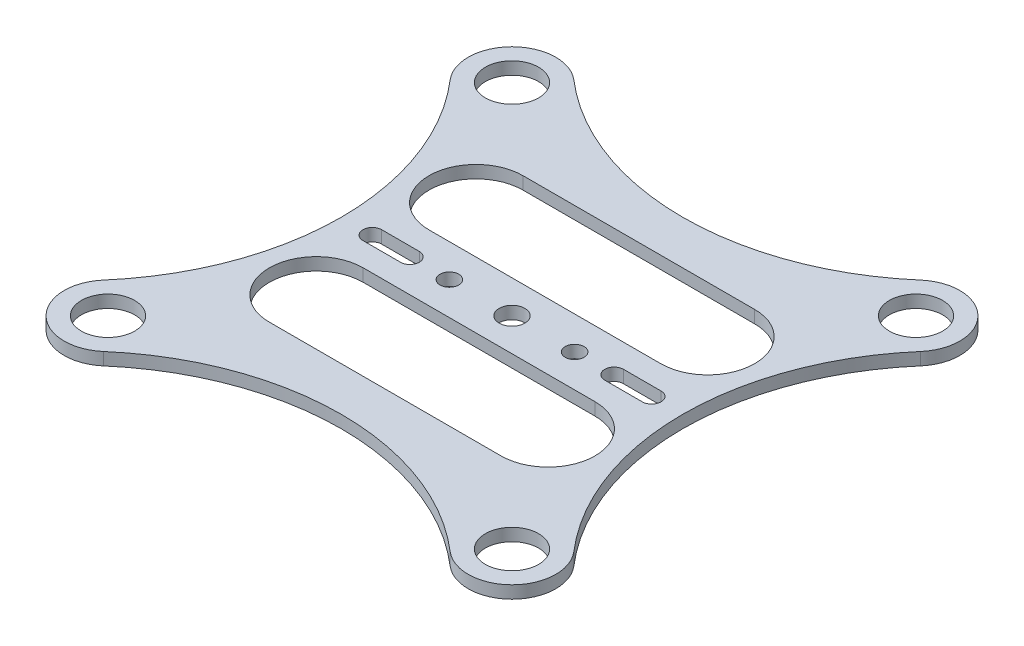
ISO-10303-21;
HEADER;
FILE_DESCRIPTION(('STEP AP214'),'2;1');
FILE_NAME('part.step','',(''),(''),'','','');
FILE_SCHEMA(('AUTOMOTIVE_DESIGN { 1 0 10303 214 1 1 1 1 }'));
ENDSEC;
DATA;
#1=APPLICATION_CONTEXT('core data for automotive mechanical design processes');
#2=APPLICATION_PROTOCOL_DEFINITION('international standard','automotive_design',2000,#1);
#3=PRODUCT_CONTEXT('',#1,'mechanical');
#4=PRODUCT('Part','Part','',(#3));
#5=PRODUCT_RELATED_PRODUCT_CATEGORY('part','',(#4));
#6=PRODUCT_DEFINITION_FORMATION('','',#4);
#7=PRODUCT_DEFINITION_CONTEXT('part definition',#1,'design');
#8=PRODUCT_DEFINITION('design','',#6,#7);
#9=PRODUCT_DEFINITION_SHAPE('','',#8);
#10=(LENGTH_UNIT() NAMED_UNIT(*) SI_UNIT(.MILLI.,.METRE.));
#11=(NAMED_UNIT(*) PLANE_ANGLE_UNIT() SI_UNIT($,.RADIAN.));
#12=(NAMED_UNIT(*) SI_UNIT($,.STERADIAN.) SOLID_ANGLE_UNIT());
#13=UNCERTAINTY_MEASURE_WITH_UNIT(LENGTH_MEASURE(1.E-05),#10,'distance_accuracy_value','');
#14=(GEOMETRIC_REPRESENTATION_CONTEXT(3) GLOBAL_UNCERTAINTY_ASSIGNED_CONTEXT((#13)) GLOBAL_UNIT_ASSIGNED_CONTEXT((#10,
#11,#12)) REPRESENTATION_CONTEXT('',''));
#15=CARTESIAN_POINT('',(0.,0.,0.));
#16=DIRECTION('',(0.,0.,1.));
#17=DIRECTION('',(1.,0.,0.));
#18=AXIS2_PLACEMENT_3D('',#15,#16,#17);
#19=CARTESIAN_POINT('',(0.,2.,0.));
#20=DIRECTION('',(0.,1.,0.));
#21=DIRECTION('',(0.,0.,1.));
#22=AXIS2_PLACEMENT_3D('',#19,#20,#21);
#23=PLANE('',#22);
#24=CARTESIAN_POINT('',(-32.25,2.,32.25));
#25=DIRECTION('',(0.,1.,0.));
#26=DIRECTION('',(0.,0.,1.));
#27=AXIS2_PLACEMENT_3D('',#24,#25,#26);
#28=CIRCLE('',#27,4.25);
#29=CARTESIAN_POINT('',(-32.25,2.,36.5));
#30=VERTEX_POINT('',#29);
#31=EDGE_CURVE('E328',#30,#30,#28,.F.);
#32=ORIENTED_EDGE('',*,*,#31,.T.);
#33=EDGE_LOOP('',(#32));
#34=FACE_BOUND('',#33,.T.);
#35=CARTESIAN_POINT('',(-32.25,2.,-32.25));
#36=DIRECTION('',(0.,1.,0.));
#37=DIRECTION('',(0.,0.,1.));
#38=AXIS2_PLACEMENT_3D('',#35,#36,#37);
#39=CIRCLE('',#38,4.25);
#40=CARTESIAN_POINT('',(-32.25,2.,-28.));
#41=VERTEX_POINT('',#40);
#42=EDGE_CURVE('E331',#41,#41,#39,.F.);
#43=ORIENTED_EDGE('',*,*,#42,.T.);
#44=EDGE_LOOP('',(#43));
#45=FACE_BOUND('',#44,.T.);
#46=CARTESIAN_POINT('',(32.25,2.,32.25));
#47=DIRECTION('',(0.,1.,0.));
#48=DIRECTION('',(0.,0.,1.));
#49=AXIS2_PLACEMENT_3D('',#46,#47,#48);
#50=CIRCLE('',#49,4.25);
#51=CARTESIAN_POINT('',(32.25,2.,36.5));
#52=VERTEX_POINT('',#51);
#53=EDGE_CURVE('E334',#52,#52,#50,.F.);
#54=ORIENTED_EDGE('',*,*,#53,.T.);
#55=EDGE_LOOP('',(#54));
#56=FACE_BOUND('',#55,.T.);
#57=CARTESIAN_POINT('',(32.25,2.,-32.25));
#58=DIRECTION('',(0.,1.,0.));
#59=DIRECTION('',(0.,0.,1.));
#60=AXIS2_PLACEMENT_3D('',#57,#58,#59);
#61=CIRCLE('',#60,4.25);
#62=CARTESIAN_POINT('',(32.25,2.,-28.));
#63=VERTEX_POINT('',#62);
#64=EDGE_CURVE('E337',#63,#63,#61,.F.);
#65=ORIENTED_EDGE('',*,*,#64,.T.);
#66=EDGE_LOOP('',(#65));
#67=FACE_BOUND('',#66,.T.);
#68=DIRECTION('',(1.,0.,0.));
#69=VECTOR('',#68,1.);
#70=CARTESIAN_POINT('',(18.5,2.,-5.25));
#71=LINE('',#70,#69);
#72=CARTESIAN_POINT('',(18.5,2.,-5.25));
#73=VERTEX_POINT('',#72);
#74=CARTESIAN_POINT('',(-18.5,2.,-5.25));
#75=VERTEX_POINT('',#74);
#76=EDGE_CURVE('E231',#73,#75,#71,.F.);
#77=ORIENTED_EDGE('',*,*,#76,.T.);
#78=CARTESIAN_POINT('',(-18.5,2.,-12.75));
#79=DIRECTION('',(0.,-1.,0.));
#80=DIRECTION('',(0.,0.,-1.));
#81=AXIS2_PLACEMENT_3D('',#78,#79,#80);
#82=CIRCLE('',#81,7.5);
#83=CARTESIAN_POINT('',(-18.5,2.,-20.25));
#84=VERTEX_POINT('',#83);
#85=EDGE_CURVE('E340',#75,#84,#82,.T.);
#86=ORIENTED_EDGE('',*,*,#85,.T.);
#87=DIRECTION('',(-1.,0.,0.));
#88=VECTOR('',#87,1.);
#89=CARTESIAN_POINT('',(-18.5,2.,-20.25));
#90=LINE('',#89,#88);
#91=CARTESIAN_POINT('',(18.5,2.,-20.25));
#92=VERTEX_POINT('',#91);
#93=EDGE_CURVE('E227',#84,#92,#90,.F.);
#94=ORIENTED_EDGE('',*,*,#93,.T.);
#95=CARTESIAN_POINT('',(18.5,2.,-12.75));
#96=DIRECTION('',(0.,-1.,0.));
#97=DIRECTION('',(0.,0.,-1.));
#98=AXIS2_PLACEMENT_3D('',#95,#96,#97);
#99=CIRCLE('',#98,7.5);
#100=EDGE_CURVE('E342',#92,#73,#99,.T.);
#101=ORIENTED_EDGE('',*,*,#100,.T.);
#102=EDGE_LOOP('',(#77,#86,#94,#101));
#103=FACE_BOUND('',#102,.T.);
#104=DIRECTION('',(-1.,0.,0.));
#105=VECTOR('',#104,1.);
#106=CARTESIAN_POINT('',(-18.5,2.,20.25));
#107=LINE('',#106,#105);
#108=CARTESIAN_POINT('',(-18.5,2.,20.25));
#109=VERTEX_POINT('',#108);
#110=CARTESIAN_POINT('',(18.5,2.,20.25));
#111=VERTEX_POINT('',#110);
#112=EDGE_CURVE('E239',#109,#111,#107,.F.);
#113=ORIENTED_EDGE('',*,*,#112,.F.);
#114=CARTESIAN_POINT('',(-18.5,2.,12.75));
#115=DIRECTION('',(0.,1.,0.));
#116=DIRECTION('',(0.,0.,1.));
#117=AXIS2_PLACEMENT_3D('',#114,#115,#116);
#118=CIRCLE('',#117,7.5);
#119=CARTESIAN_POINT('',(-18.5,2.,5.25));
#120=VERTEX_POINT('',#119);
#121=EDGE_CURVE('E344',#109,#120,#118,.F.);
#122=ORIENTED_EDGE('',*,*,#121,.T.);
#123=DIRECTION('',(1.,0.,0.));
#124=VECTOR('',#123,1.);
#125=CARTESIAN_POINT('',(18.5,2.,5.25));
#126=LINE('',#125,#124);
#127=CARTESIAN_POINT('',(18.5,2.,5.25));
#128=VERTEX_POINT('',#127);
#129=EDGE_CURVE('E235',#128,#120,#126,.F.);
#130=ORIENTED_EDGE('',*,*,#129,.F.);
#131=CARTESIAN_POINT('',(18.5,2.,12.75));
#132=DIRECTION('',(0.,1.,0.));
#133=DIRECTION('',(0.,0.,1.));
#134=AXIS2_PLACEMENT_3D('',#131,#132,#133);
#135=CIRCLE('',#134,7.5);
#136=EDGE_CURVE('E242',#128,#111,#135,.F.);
#137=ORIENTED_EDGE('',*,*,#136,.T.);
#138=EDGE_LOOP('',(#113,#122,#130,#137));
#139=FACE_BOUND('',#138,.T.);
#140=CARTESIAN_POINT('',(-16.3,2.,0.));
#141=DIRECTION('',(0.,-1.,0.));
#142=DIRECTION('',(0.,0.,-1.));
#143=AXIS2_PLACEMENT_3D('',#140,#141,#142);
#144=CIRCLE('',#143,1.5);
#145=CARTESIAN_POINT('',(-16.3,2.,-1.5));
#146=VERTEX_POINT('',#145);
#147=CARTESIAN_POINT('',(-16.3,2.,1.5));
#148=VERTEX_POINT('',#147);
#149=EDGE_CURVE('E354',#146,#148,#144,.T.);
#150=ORIENTED_EDGE('',*,*,#149,.T.);
#151=DIRECTION('',(1.,0.,0.));
#152=VECTOR('',#151,1.);
#153=CARTESIAN_POINT('',(-16.3,2.,1.5));
#154=LINE('',#153,#152);
#155=CARTESIAN_POINT('',(-22.3,2.,1.5));
#156=VERTEX_POINT('',#155);
#157=EDGE_CURVE('E247',#148,#156,#154,.F.);
#158=ORIENTED_EDGE('',*,*,#157,.T.);
#159=CARTESIAN_POINT('',(-22.3,2.,0.));
#160=DIRECTION('',(0.,-1.,0.));
#161=DIRECTION('',(0.,0.,-1.));
#162=AXIS2_PLACEMENT_3D('',#159,#160,#161);
#163=CIRCLE('',#162,1.5);
#164=CARTESIAN_POINT('',(-22.3,2.,-1.5));
#165=VERTEX_POINT('',#164);
#166=EDGE_CURVE('E351',#156,#165,#163,.T.);
#167=ORIENTED_EDGE('',*,*,#166,.T.);
#168=DIRECTION('',(-1.,0.,0.));
#169=VECTOR('',#168,1.);
#170=CARTESIAN_POINT('',(-22.3,2.,-1.5));
#171=LINE('',#170,#169);
#172=EDGE_CURVE('E243',#165,#146,#171,.F.);
#173=ORIENTED_EDGE('',*,*,#172,.T.);
#174=EDGE_LOOP('',(#150,#158,#167,#173));
#175=FACE_BOUND('',#174,.T.);
#176=CARTESIAN_POINT('',(22.3,2.,0.));
#177=DIRECTION('',(0.,-1.,0.));
#178=DIRECTION('',(0.,0.,-1.));
#179=AXIS2_PLACEMENT_3D('',#176,#177,#178);
#180=CIRCLE('',#179,1.5);
#181=CARTESIAN_POINT('',(22.3,2.,-1.5));
#182=VERTEX_POINT('',#181);
#183=CARTESIAN_POINT('',(22.3,2.,1.5));
#184=VERTEX_POINT('',#183);
#185=EDGE_CURVE('E359',#182,#184,#180,.T.);
#186=ORIENTED_EDGE('',*,*,#185,.T.);
#187=DIRECTION('',(1.,0.,0.));
#188=VECTOR('',#187,1.);
#189=CARTESIAN_POINT('',(22.3,2.,1.5));
#190=LINE('',#189,#188);
#191=CARTESIAN_POINT('',(16.3,2.,1.5));
#192=VERTEX_POINT('',#191);
#193=EDGE_CURVE('E255',#184,#192,#190,.F.);
#194=ORIENTED_EDGE('',*,*,#193,.T.);
#195=CARTESIAN_POINT('',(16.3,2.,0.));
#196=DIRECTION('',(0.,-1.,0.));
#197=DIRECTION('',(0.,0.,-1.));
#198=AXIS2_PLACEMENT_3D('',#195,#196,#197);
#199=CIRCLE('',#198,1.5);
#200=CARTESIAN_POINT('',(16.3,2.,-1.5));
#201=VERTEX_POINT('',#200);
#202=EDGE_CURVE('E356',#192,#201,#199,.T.);
#203=ORIENTED_EDGE('',*,*,#202,.T.);
#204=DIRECTION('',(-1.,0.,0.));
#205=VECTOR('',#204,1.);
#206=CARTESIAN_POINT('',(16.3,2.,-1.5));
#207=LINE('',#206,#205);
#208=EDGE_CURVE('E251',#201,#182,#207,.F.);
#209=ORIENTED_EDGE('',*,*,#208,.T.);
#210=EDGE_LOOP('',(#186,#194,#203,#209));
#211=FACE_BOUND('',#210,.T.);
#212=CARTESIAN_POINT('',(-10.,2.,0.));
#213=DIRECTION('',(0.,-1.,0.));
#214=DIRECTION('',(0.,0.,-1.));
#215=AXIS2_PLACEMENT_3D('',#212,#213,#214);
#216=CIRCLE('',#215,1.5);
#217=CARTESIAN_POINT('',(-10.,2.,-1.5));
#218=VERTEX_POINT('',#217);
#219=EDGE_CURVE('E254',#218,#218,#216,.T.);
#220=ORIENTED_EDGE('',*,*,#219,.T.);
#221=EDGE_LOOP('',(#220));
#222=FACE_BOUND('',#221,.T.);
#223=CARTESIAN_POINT('',(10.,2.,0.));
#224=DIRECTION('',(0.,-1.,0.));
#225=DIRECTION('',(0.,0.,-1.));
#226=AXIS2_PLACEMENT_3D('',#223,#224,#225);
#227=CIRCLE('',#226,1.5);
#228=CARTESIAN_POINT('',(10.,2.,-1.5));
#229=VERTEX_POINT('',#228);
#230=EDGE_CURVE('E362',#229,#229,#227,.T.);
#231=ORIENTED_EDGE('',*,*,#230,.T.);
#232=EDGE_LOOP('',(#231));
#233=FACE_BOUND('',#232,.T.);
#234=CARTESIAN_POINT('',(0.,2.,0.));
#235=DIRECTION('',(0.,-1.,0.));
#236=DIRECTION('',(0.,0.,-1.));
#237=AXIS2_PLACEMENT_3D('',#234,#235,#236);
#238=CIRCLE('',#237,2.05);
#239=CARTESIAN_POINT('',(0.,2.,-2.05));
#240=VERTEX_POINT('',#239);
#241=EDGE_CURVE('E198',#240,#240,#238,.T.);
#242=ORIENTED_EDGE('',*,*,#241,.T.);
#243=EDGE_LOOP('',(#242));
#244=FACE_BOUND('',#243,.T.);
#245=CARTESIAN_POINT('',(32.25,2.,-32.25));
#246=DIRECTION('',(0.,1.,0.));
#247=DIRECTION('',(0.,0.,1.));
#248=AXIS2_PLACEMENT_3D('',#245,#246,#247);
#249=CIRCLE('',#248,7.);
#250=CARTESIAN_POINT('',(27.6742280285036,2.,-37.5473871733967));
#251=VERTEX_POINT('',#250);
#252=CARTESIAN_POINT('',(37.5473871733967,2.,-27.6742280285036));
#253=VERTEX_POINT('',#252);
#254=EDGE_CURVE('E205',#251,#253,#249,.F.);
#255=ORIENTED_EDGE('',*,*,#254,.F.);
#256=CARTESIAN_POINT('',(0.,2.,-69.5859375));
#257=DIRECTION('',(0.,1.,0.));
#258=DIRECTION('',(0.,0.,1.));
#259=AXIS2_PLACEMENT_3D('',#256,#257,#258);
#260=CIRCLE('',#259,42.3359375);
#261=CARTESIAN_POINT('',(-27.6742280285036,2.,-37.5473871733967));
#262=VERTEX_POINT('',#261);
#263=EDGE_CURVE('E192',#251,#262,#260,.F.);
#264=ORIENTED_EDGE('',*,*,#263,.T.);
#265=CARTESIAN_POINT('',(-32.25,2.,-32.25));
#266=DIRECTION('',(0.,1.,0.));
#267=DIRECTION('',(0.,0.,1.));
#268=AXIS2_PLACEMENT_3D('',#265,#266,#267);
#269=CIRCLE('',#268,7.);
#270=CARTESIAN_POINT('',(-37.5473871733967,2.,-27.6742280285036));
#271=VERTEX_POINT('',#270);
#272=EDGE_CURVE('E188',#271,#262,#269,.F.);
#273=ORIENTED_EDGE('',*,*,#272,.F.);
#274=CARTESIAN_POINT('',(-69.5859375,2.,0.));
#275=DIRECTION('',(0.,1.,0.));
#276=DIRECTION('',(0.,0.,1.));
#277=AXIS2_PLACEMENT_3D('',#274,#275,#276);
#278=CIRCLE('',#277,42.3359375);
#279=CARTESIAN_POINT('',(-37.5473871733967,2.,27.6742280285035));
#280=VERTEX_POINT('',#279);
#281=EDGE_CURVE('E20',#271,#280,#278,.F.);
#282=ORIENTED_EDGE('',*,*,#281,.T.);
#283=CARTESIAN_POINT('',(-32.25,2.,32.25));
#284=DIRECTION('',(0.,1.,0.));
#285=DIRECTION('',(0.,0.,1.));
#286=AXIS2_PLACEMENT_3D('',#283,#284,#285);
#287=CIRCLE('',#286,7.);
#288=CARTESIAN_POINT('',(-27.6742280285036,2.,37.5473871733967));
#289=VERTEX_POINT('',#288);
#290=EDGE_CURVE('E185',#289,#280,#287,.F.);
#291=ORIENTED_EDGE('',*,*,#290,.F.);
#292=CARTESIAN_POINT('',(0.,2.,69.5859375));
#293=DIRECTION('',(0.,1.,0.));
#294=DIRECTION('',(0.,0.,1.));
#295=AXIS2_PLACEMENT_3D('',#292,#293,#294);
#296=CIRCLE('',#295,42.3359375);
#297=CARTESIAN_POINT('',(27.6742280285036,2.,37.5473871733967));
#298=VERTEX_POINT('',#297);
#299=EDGE_CURVE('E215',#289,#298,#296,.F.);
#300=ORIENTED_EDGE('',*,*,#299,.T.);
#301=CARTESIAN_POINT('',(32.25,2.,32.25));
#302=DIRECTION('',(0.,1.,0.));
#303=DIRECTION('',(0.,0.,1.));
#304=AXIS2_PLACEMENT_3D('',#301,#302,#303);
#305=CIRCLE('',#304,7.);
#306=CARTESIAN_POINT('',(37.5473871733967,2.,27.6742280285036));
#307=VERTEX_POINT('',#306);
#308=EDGE_CURVE('E212',#307,#298,#305,.F.);
#309=ORIENTED_EDGE('',*,*,#308,.F.);
#310=CARTESIAN_POINT('',(69.5859375,2.,0.));
#311=DIRECTION('',(0.,1.,0.));
#312=DIRECTION('',(0.,0.,1.));
#313=AXIS2_PLACEMENT_3D('',#310,#311,#312);
#314=CIRCLE('',#313,42.3359375);
#315=EDGE_CURVE('E208',#307,#253,#314,.F.);
#316=ORIENTED_EDGE('',*,*,#315,.T.);
#317=EDGE_LOOP('',(#255,#264,#273,#282,#291,#300,#309,#316));
#318=FACE_BOUND('',#317,.T.);
#319=ADVANCED_FACE('F17',(#34,#45,#56,#67,#103,#139,#175,#211,#222,#233,#244,#318),#23,.T.);
#320=CARTESIAN_POINT('',(-69.5859375,0.,0.));
#321=DIRECTION('',(0.,1.,0.));
#322=DIRECTION('',(0.,0.,1.));
#323=AXIS2_PLACEMENT_3D('',#320,#321,#322);
#324=CYLINDRICAL_SURFACE('',#323,42.3359375);
#325=DIRECTION('',(0.,1.,0.));
#326=VECTOR('',#325,1.);
#327=CARTESIAN_POINT('',(-37.5473871733967,0.,27.6742280285035));
#328=LINE('',#327,#326);
#329=CARTESIAN_POINT('',(-37.5473871733967,0.,27.6742280285035));
#330=VERTEX_POINT('',#329);
#331=EDGE_CURVE('E182',#280,#330,#328,.F.);
#332=ORIENTED_EDGE('',*,*,#331,.F.);
#333=ORIENTED_EDGE('',*,*,#281,.F.);
#334=DIRECTION('',(0.,1.,0.));
#335=VECTOR('',#334,1.);
#336=CARTESIAN_POINT('',(-37.5473871733967,0.,-27.6742280285035));
#337=LINE('',#336,#335);
#338=CARTESIAN_POINT('',(-37.5473871733967,0.,-27.6742280285036));
#339=VERTEX_POINT('',#338);
#340=EDGE_CURVE('E180',#339,#271,#337,.T.);
#341=ORIENTED_EDGE('',*,*,#340,.F.);
#342=CARTESIAN_POINT('',(-69.5859375,0.,0.));
#343=DIRECTION('',(0.,1.,0.));
#344=DIRECTION('',(0.,0.,1.));
#345=AXIS2_PLACEMENT_3D('',#342,#343,#344);
#346=CIRCLE('',#345,42.3359375);
#347=EDGE_CURVE('E326',#339,#330,#346,.F.);
#348=ORIENTED_EDGE('',*,*,#347,.T.);
#349=EDGE_LOOP('',(#332,#333,#341,#348));
#350=FACE_BOUND('',#349,.T.);
#351=ADVANCED_FACE('F178',(#350),#324,.F.);
#352=CARTESIAN_POINT('',(-32.25,0.,32.25));
#353=DIRECTION('',(0.,1.,0.));
#354=DIRECTION('',(0.,0.,1.));
#355=AXIS2_PLACEMENT_3D('',#352,#353,#354);
#356=CYLINDRICAL_SURFACE('',#355,7.);
#357=ORIENTED_EDGE('',*,*,#290,.T.);
#358=ORIENTED_EDGE('',*,*,#331,.T.);
#359=CARTESIAN_POINT('',(-32.25,0.,32.25));
#360=DIRECTION('',(0.,1.,0.));
#361=DIRECTION('',(0.,0.,1.));
#362=AXIS2_PLACEMENT_3D('',#359,#360,#361);
#363=CIRCLE('',#362,7.);
#364=CARTESIAN_POINT('',(-27.6742280285036,0.,37.5473871733967));
#365=VERTEX_POINT('',#364);
#366=EDGE_CURVE('E324',#330,#365,#363,.T.);
#367=ORIENTED_EDGE('',*,*,#366,.T.);
#368=DIRECTION('',(0.,1.,0.));
#369=VECTOR('',#368,1.);
#370=CARTESIAN_POINT('',(-27.6742280285036,0.,37.5473871733967));
#371=LINE('',#370,#369);
#372=EDGE_CURVE('E217',#365,#289,#371,.T.);
#373=ORIENTED_EDGE('',*,*,#372,.T.);
#374=EDGE_LOOP('',(#357,#358,#367,#373));
#375=FACE_BOUND('',#374,.T.);
#376=ADVANCED_FACE('F486',(#375),#356,.T.);
#377=CARTESIAN_POINT('',(0.,0.,69.5859375));
#378=DIRECTION('',(0.,1.,0.));
#379=DIRECTION('',(0.,0.,1.));
#380=AXIS2_PLACEMENT_3D('',#377,#378,#379);
#381=CYLINDRICAL_SURFACE('',#380,42.3359375);
#382=DIRECTION('',(0.,1.,0.));
#383=VECTOR('',#382,1.);
#384=CARTESIAN_POINT('',(27.6742280285036,0.,37.5473871733967));
#385=LINE('',#384,#383);
#386=CARTESIAN_POINT('',(27.6742280285036,0.,37.5473871733967));
#387=VERTEX_POINT('',#386);
#388=EDGE_CURVE('E214',#298,#387,#385,.F.);
#389=ORIENTED_EDGE('',*,*,#388,.F.);
#390=ORIENTED_EDGE('',*,*,#299,.F.);
#391=ORIENTED_EDGE('',*,*,#372,.F.);
#392=CARTESIAN_POINT('',(0.,0.,69.5859375));
#393=DIRECTION('',(0.,1.,0.));
#394=DIRECTION('',(0.,0.,1.));
#395=AXIS2_PLACEMENT_3D('',#392,#393,#394);
#396=CIRCLE('',#395,42.3359375);
#397=EDGE_CURVE('E321',#365,#387,#396,.F.);
#398=ORIENTED_EDGE('',*,*,#397,.T.);
#399=EDGE_LOOP('',(#389,#390,#391,#398));
#400=FACE_BOUND('',#399,.T.);
#401=ADVANCED_FACE('F532',(#400),#381,.F.);
#402=CARTESIAN_POINT('',(32.25,0.,32.25));
#403=DIRECTION('',(0.,1.,0.));
#404=DIRECTION('',(0.,0.,1.));
#405=AXIS2_PLACEMENT_3D('',#402,#403,#404);
#406=CYLINDRICAL_SURFACE('',#405,7.);
#407=ORIENTED_EDGE('',*,*,#308,.T.);
#408=ORIENTED_EDGE('',*,*,#388,.T.);
#409=CARTESIAN_POINT('',(32.25,0.,32.25));
#410=DIRECTION('',(0.,1.,0.));
#411=DIRECTION('',(0.,0.,1.));
#412=AXIS2_PLACEMENT_3D('',#409,#410,#411);
#413=CIRCLE('',#412,7.);
#414=CARTESIAN_POINT('',(37.5473871733967,0.,27.6742280285036));
#415=VERTEX_POINT('',#414);
#416=EDGE_CURVE('E318',#387,#415,#413,.T.);
#417=ORIENTED_EDGE('',*,*,#416,.T.);
#418=DIRECTION('',(0.,1.,0.));
#419=VECTOR('',#418,1.);
#420=CARTESIAN_POINT('',(37.5473871733967,0.,27.6742280285036));
#421=LINE('',#420,#419);
#422=EDGE_CURVE('E211',#415,#307,#421,.T.);
#423=ORIENTED_EDGE('',*,*,#422,.T.);
#424=EDGE_LOOP('',(#407,#408,#417,#423));
#425=FACE_BOUND('',#424,.T.);
#426=ADVANCED_FACE('F524',(#425),#406,.T.);
#427=CARTESIAN_POINT('',(69.5859375,0.,0.));
#428=DIRECTION('',(0.,1.,0.));
#429=DIRECTION('',(0.,0.,1.));
#430=AXIS2_PLACEMENT_3D('',#427,#428,#429);
#431=CYLINDRICAL_SURFACE('',#430,42.3359375);
#432=DIRECTION('',(0.,1.,0.));
#433=VECTOR('',#432,1.);
#434=CARTESIAN_POINT('',(37.5473871733967,0.,-27.6742280285036));
#435=LINE('',#434,#433);
#436=CARTESIAN_POINT('',(37.5473871733967,0.,-27.6742280285036));
#437=VERTEX_POINT('',#436);
#438=EDGE_CURVE('E207',#253,#437,#435,.F.);
#439=ORIENTED_EDGE('',*,*,#438,.F.);
#440=ORIENTED_EDGE('',*,*,#315,.F.);
#441=ORIENTED_EDGE('',*,*,#422,.F.);
#442=CARTESIAN_POINT('',(69.5859375,0.,0.));
#443=DIRECTION('',(0.,1.,0.));
#444=DIRECTION('',(0.,0.,1.));
#445=AXIS2_PLACEMENT_3D('',#442,#443,#444);
#446=CIRCLE('',#445,42.3359375);
#447=EDGE_CURVE('E315',#415,#437,#446,.F.);
#448=ORIENTED_EDGE('',*,*,#447,.T.);
#449=EDGE_LOOP('',(#439,#440,#441,#448));
#450=FACE_BOUND('',#449,.T.);
#451=ADVANCED_FACE('F538',(#450),#431,.F.);
#452=CARTESIAN_POINT('',(32.25,0.,-32.25));
#453=DIRECTION('',(0.,1.,0.));
#454=DIRECTION('',(0.,0.,1.));
#455=AXIS2_PLACEMENT_3D('',#452,#453,#454);
#456=CYLINDRICAL_SURFACE('',#455,7.);
#457=ORIENTED_EDGE('',*,*,#254,.T.);
#458=ORIENTED_EDGE('',*,*,#438,.T.);
#459=CARTESIAN_POINT('',(32.25,0.,-32.25));
#460=DIRECTION('',(0.,1.,0.));
#461=DIRECTION('',(0.,0.,1.));
#462=AXIS2_PLACEMENT_3D('',#459,#460,#461);
#463=CIRCLE('',#462,7.);
#464=CARTESIAN_POINT('',(27.6742280285036,0.,-37.5473871733967));
#465=VERTEX_POINT('',#464);
#466=EDGE_CURVE('E312',#437,#465,#463,.T.);
#467=ORIENTED_EDGE('',*,*,#466,.T.);
#468=DIRECTION('',(0.,1.,0.));
#469=VECTOR('',#468,1.);
#470=CARTESIAN_POINT('',(27.6742280285036,0.,-37.5473871733967));
#471=LINE('',#470,#469);
#472=EDGE_CURVE('E204',#465,#251,#471,.T.);
#473=ORIENTED_EDGE('',*,*,#472,.T.);
#474=EDGE_LOOP('',(#457,#458,#467,#473));
#475=FACE_BOUND('',#474,.T.);
#476=ADVANCED_FACE('F535',(#475),#456,.T.);
#477=CARTESIAN_POINT('',(0.,0.,-69.5859375));
#478=DIRECTION('',(0.,1.,0.));
#479=DIRECTION('',(0.,0.,1.));
#480=AXIS2_PLACEMENT_3D('',#477,#478,#479);
#481=CYLINDRICAL_SURFACE('',#480,42.3359375);
#482=DIRECTION('',(0.,1.,0.));
#483=VECTOR('',#482,1.);
#484=CARTESIAN_POINT('',(-27.6742280285036,0.,-37.5473871733967));
#485=LINE('',#484,#483);
#486=CARTESIAN_POINT('',(-27.6742280285036,0.,-37.5473871733967));
#487=VERTEX_POINT('',#486);
#488=EDGE_CURVE('E196',#262,#487,#485,.F.);
#489=ORIENTED_EDGE('',*,*,#488,.F.);
#490=ORIENTED_EDGE('',*,*,#263,.F.);
#491=ORIENTED_EDGE('',*,*,#472,.F.);
#492=CARTESIAN_POINT('',(0.,0.,-69.5859375));
#493=DIRECTION('',(0.,1.,0.));
#494=DIRECTION('',(0.,0.,1.));
#495=AXIS2_PLACEMENT_3D('',#492,#493,#494);
#496=CIRCLE('',#495,42.3359375);
#497=EDGE_CURVE('E309',#465,#487,#496,.F.);
#498=ORIENTED_EDGE('',*,*,#497,.T.);
#499=EDGE_LOOP('',(#489,#490,#491,#498));
#500=FACE_BOUND('',#499,.T.);
#501=ADVANCED_FACE('F383',(#500),#481,.F.);
#502=CARTESIAN_POINT('',(-32.25,0.,-32.25));
#503=DIRECTION('',(0.,1.,0.));
#504=DIRECTION('',(0.,0.,1.));
#505=AXIS2_PLACEMENT_3D('',#502,#503,#504);
#506=CYLINDRICAL_SURFACE('',#505,7.);
#507=ORIENTED_EDGE('',*,*,#272,.T.);
#508=ORIENTED_EDGE('',*,*,#488,.T.);
#509=CARTESIAN_POINT('',(-32.25,0.,-32.25));
#510=DIRECTION('',(0.,1.,0.));
#511=DIRECTION('',(0.,0.,1.));
#512=AXIS2_PLACEMENT_3D('',#509,#510,#511);
#513=CIRCLE('',#512,7.);
#514=EDGE_CURVE('E191',#487,#339,#513,.T.);
#515=ORIENTED_EDGE('',*,*,#514,.T.);
#516=ORIENTED_EDGE('',*,*,#340,.T.);
#517=EDGE_LOOP('',(#507,#508,#515,#516));
#518=FACE_BOUND('',#517,.T.);
#519=ADVANCED_FACE('F187',(#518),#506,.T.);
#520=CARTESIAN_POINT('',(0.,2.,0.));
#521=DIRECTION('',(0.,-1.,0.));
#522=DIRECTION('',(0.,0.,-1.));
#523=AXIS2_PLACEMENT_3D('',#520,#521,#522);
#524=CYLINDRICAL_SURFACE('',#523,2.05);
#525=CARTESIAN_POINT('',(0.,0.,0.));
#526=DIRECTION('',(0.,-1.,0.));
#527=DIRECTION('',(0.,0.,-1.));
#528=AXIS2_PLACEMENT_3D('',#525,#526,#527);
#529=CIRCLE('',#528,2.05);
#530=CARTESIAN_POINT('',(0.,0.,-2.05));
#531=VERTEX_POINT('',#530);
#532=EDGE_CURVE('E305',#531,#531,#529,.T.);
#533=ORIENTED_EDGE('',*,*,#532,.T.);
#534=EDGE_LOOP('',(#533));
#535=FACE_BOUND('',#534,.T.);
#536=ORIENTED_EDGE('',*,*,#241,.F.);
#537=EDGE_LOOP('',(#536));
#538=FACE_BOUND('',#537,.T.);
#539=ADVANCED_FACE('F370',(#535,#538),#524,.F.);
#540=CARTESIAN_POINT('',(10.,2.,0.));
#541=DIRECTION('',(0.,-1.,0.));
#542=DIRECTION('',(0.,0.,-1.));
#543=AXIS2_PLACEMENT_3D('',#540,#541,#542);
#544=CYLINDRICAL_SURFACE('',#543,1.5);
#545=CARTESIAN_POINT('',(10.,0.,0.));
#546=DIRECTION('',(0.,-1.,0.));
#547=DIRECTION('',(0.,0.,-1.));
#548=AXIS2_PLACEMENT_3D('',#545,#546,#547);
#549=CIRCLE('',#548,1.5);
#550=CARTESIAN_POINT('',(10.,0.,-1.5));
#551=VERTEX_POINT('',#550);
#552=EDGE_CURVE('E302',#551,#551,#549,.T.);
#553=ORIENTED_EDGE('',*,*,#552,.T.);
#554=EDGE_LOOP('',(#553));
#555=FACE_BOUND('',#554,.T.);
#556=ORIENTED_EDGE('',*,*,#230,.F.);
#557=EDGE_LOOP('',(#556));
#558=FACE_BOUND('',#557,.T.);
#559=ADVANCED_FACE('F372',(#555,#558),#544,.F.);
#560=CARTESIAN_POINT('',(-10.,2.,0.));
#561=DIRECTION('',(0.,-1.,0.));
#562=DIRECTION('',(0.,0.,-1.));
#563=AXIS2_PLACEMENT_3D('',#560,#561,#562);
#564=CYLINDRICAL_SURFACE('',#563,1.5);
#565=CARTESIAN_POINT('',(-10.,0.,0.));
#566=DIRECTION('',(0.,-1.,0.));
#567=DIRECTION('',(0.,0.,-1.));
#568=AXIS2_PLACEMENT_3D('',#565,#566,#567);
#569=CIRCLE('',#568,1.5);
#570=CARTESIAN_POINT('',(-10.,0.,-1.5));
#571=VERTEX_POINT('',#570);
#572=EDGE_CURVE('E299',#571,#571,#569,.T.);
#573=ORIENTED_EDGE('',*,*,#572,.T.);
#574=EDGE_LOOP('',(#573));
#575=FACE_BOUND('',#574,.T.);
#576=ORIENTED_EDGE('',*,*,#219,.F.);
#577=EDGE_LOOP('',(#576));
#578=FACE_BOUND('',#577,.T.);
#579=ADVANCED_FACE('F380',(#575,#578),#564,.F.);
#580=CARTESIAN_POINT('',(16.3,2.,-1.5));
#581=DIRECTION('',(0.,0.,-1.));
#582=DIRECTION('',(-1.,0.,0.));
#583=AXIS2_PLACEMENT_3D('',#580,#581,#582);
#584=PLANE('',#583);
#585=DIRECTION('',(0.,-1.,0.));
#586=VECTOR('',#585,1.);
#587=CARTESIAN_POINT('',(22.3,2.,-1.5));
#588=LINE('',#587,#586);
#589=CARTESIAN_POINT('',(22.3,0.,-1.5));
#590=VERTEX_POINT('',#589);
#591=EDGE_CURVE('E253',#590,#182,#588,.F.);
#592=ORIENTED_EDGE('',*,*,#591,.T.);
#593=ORIENTED_EDGE('',*,*,#208,.F.);
#594=DIRECTION('',(0.,-1.,0.));
#595=VECTOR('',#594,1.);
#596=CARTESIAN_POINT('',(16.3,2.,-1.5));
#597=LINE('',#596,#595);
#598=CARTESIAN_POINT('',(16.3,0.,-1.5));
#599=VERTEX_POINT('',#598);
#600=EDGE_CURVE('E246',#201,#599,#597,.T.);
#601=ORIENTED_EDGE('',*,*,#600,.T.);
#602=DIRECTION('',(1.,0.,0.));
#603=VECTOR('',#602,1.);
#604=CARTESIAN_POINT('',(0.,0.,-1.5));
#605=LINE('',#604,#603);
#606=EDGE_CURVE('E298',#599,#590,#605,.T.);
#607=ORIENTED_EDGE('',*,*,#606,.T.);
#608=EDGE_LOOP('',(#592,#593,#601,#607));
#609=FACE_BOUND('',#608,.T.);
#610=ADVANCED_FACE('F468',(#609),#584,.F.);
#611=CARTESIAN_POINT('',(22.3,2.,0.));
#612=DIRECTION('',(0.,-1.,0.));
#613=DIRECTION('',(0.,0.,-1.));
#614=AXIS2_PLACEMENT_3D('',#611,#612,#613);
#615=CYLINDRICAL_SURFACE('',#614,1.5);
#616=DIRECTION('',(0.,1.,0.));
#617=VECTOR('',#616,1.);
#618=CARTESIAN_POINT('',(22.3,2.,1.5));
#619=LINE('',#618,#617);
#620=CARTESIAN_POINT('',(22.3,0.,1.5));
#621=VERTEX_POINT('',#620);
#622=EDGE_CURVE('E257',#621,#184,#619,.T.);
#623=ORIENTED_EDGE('',*,*,#622,.T.);
#624=ORIENTED_EDGE('',*,*,#185,.F.);
#625=ORIENTED_EDGE('',*,*,#591,.F.);
#626=CARTESIAN_POINT('',(22.3,0.,0.));
#627=DIRECTION('',(0.,-1.,0.));
#628=DIRECTION('',(0.,0.,-1.));
#629=AXIS2_PLACEMENT_3D('',#626,#627,#628);
#630=CIRCLE('',#629,1.5);
#631=EDGE_CURVE('E295',#590,#621,#630,.T.);
#632=ORIENTED_EDGE('',*,*,#631,.T.);
#633=EDGE_LOOP('',(#623,#624,#625,#632));
#634=FACE_BOUND('',#633,.T.);
#635=ADVANCED_FACE('F464',(#634),#615,.F.);
#636=CARTESIAN_POINT('',(22.3,2.,1.5));
#637=DIRECTION('',(0.,0.,1.));
#638=DIRECTION('',(1.,0.,0.));
#639=AXIS2_PLACEMENT_3D('',#636,#637,#638);
#640=PLANE('',#639);
#641=DIRECTION('',(0.,-1.,0.));
#642=VECTOR('',#641,1.);
#643=CARTESIAN_POINT('',(16.3,2.,1.5));
#644=LINE('',#643,#642);
#645=CARTESIAN_POINT('',(16.3,0.,1.5));
#646=VERTEX_POINT('',#645);
#647=EDGE_CURVE('E256',#646,#192,#644,.F.);
#648=ORIENTED_EDGE('',*,*,#647,.T.);
#649=ORIENTED_EDGE('',*,*,#193,.F.);
#650=ORIENTED_EDGE('',*,*,#622,.F.);
#651=DIRECTION('',(1.,0.,0.));
#652=VECTOR('',#651,1.);
#653=CARTESIAN_POINT('',(0.,0.,1.5));
#654=LINE('',#653,#652);
#655=EDGE_CURVE('E294',#621,#646,#654,.F.);
#656=ORIENTED_EDGE('',*,*,#655,.T.);
#657=EDGE_LOOP('',(#648,#649,#650,#656));
#658=FACE_BOUND('',#657,.T.);
#659=ADVANCED_FACE('F460',(#658),#640,.F.);
#660=CARTESIAN_POINT('',(16.3,2.,0.));
#661=DIRECTION('',(0.,-1.,0.));
#662=DIRECTION('',(0.,0.,-1.));
#663=AXIS2_PLACEMENT_3D('',#660,#661,#662);
#664=CYLINDRICAL_SURFACE('',#663,1.5);
#665=ORIENTED_EDGE('',*,*,#600,.F.);
#666=ORIENTED_EDGE('',*,*,#202,.F.);
#667=ORIENTED_EDGE('',*,*,#647,.F.);
#668=CARTESIAN_POINT('',(16.3,0.,0.));
#669=DIRECTION('',(0.,-1.,0.));
#670=DIRECTION('',(0.,0.,-1.));
#671=AXIS2_PLACEMENT_3D('',#668,#669,#670);
#672=CIRCLE('',#671,1.5);
#673=EDGE_CURVE('E291',#646,#599,#672,.T.);
#674=ORIENTED_EDGE('',*,*,#673,.T.);
#675=EDGE_LOOP('',(#665,#666,#667,#674));
#676=FACE_BOUND('',#675,.T.);
#677=ADVANCED_FACE('F456',(#676),#664,.F.);
#678=CARTESIAN_POINT('',(-22.3,2.,-1.5));
#679=DIRECTION('',(0.,0.,-1.));
#680=DIRECTION('',(-1.,0.,0.));
#681=AXIS2_PLACEMENT_3D('',#678,#679,#680);
#682=PLANE('',#681);
#683=DIRECTION('',(0.,-1.,0.));
#684=VECTOR('',#683,1.);
#685=CARTESIAN_POINT('',(-16.3,2.,-1.5));
#686=LINE('',#685,#684);
#687=CARTESIAN_POINT('',(-16.3,0.,-1.5));
#688=VERTEX_POINT('',#687);
#689=EDGE_CURVE('E245',#688,#146,#686,.F.);
#690=ORIENTED_EDGE('',*,*,#689,.T.);
#691=ORIENTED_EDGE('',*,*,#172,.F.);
#692=DIRECTION('',(0.,-1.,0.));
#693=VECTOR('',#692,1.);
#694=CARTESIAN_POINT('',(-22.3,2.,-1.5));
#695=LINE('',#694,#693);
#696=CARTESIAN_POINT('',(-22.3,0.,-1.5));
#697=VERTEX_POINT('',#696);
#698=EDGE_CURVE('E350',#165,#697,#695,.T.);
#699=ORIENTED_EDGE('',*,*,#698,.T.);
#700=DIRECTION('',(1.,0.,0.));
#701=VECTOR('',#700,1.);
#702=CARTESIAN_POINT('',(0.,0.,-1.5));
#703=LINE('',#702,#701);
#704=EDGE_CURVE('E290',#697,#688,#703,.T.);
#705=ORIENTED_EDGE('',*,*,#704,.T.);
#706=EDGE_LOOP('',(#690,#691,#699,#705));
#707=FACE_BOUND('',#706,.T.);
#708=ADVANCED_FACE('F452',(#707),#682,.F.);
#709=CARTESIAN_POINT('',(-16.3,2.,0.));
#710=DIRECTION('',(0.,-1.,0.));
#711=DIRECTION('',(0.,0.,-1.));
#712=AXIS2_PLACEMENT_3D('',#709,#710,#711);
#713=CYLINDRICAL_SURFACE('',#712,1.5);
#714=DIRECTION('',(0.,1.,0.));
#715=VECTOR('',#714,1.);
#716=CARTESIAN_POINT('',(-16.3,2.,1.5));
#717=LINE('',#716,#715);
#718=CARTESIAN_POINT('',(-16.3,0.,1.5));
#719=VERTEX_POINT('',#718);
#720=EDGE_CURVE('E250',#719,#148,#717,.T.);
#721=ORIENTED_EDGE('',*,*,#720,.T.);
#722=ORIENTED_EDGE('',*,*,#149,.F.);
#723=ORIENTED_EDGE('',*,*,#689,.F.);
#724=CARTESIAN_POINT('',(-16.3,0.,0.));
#725=DIRECTION('',(0.,-1.,0.));
#726=DIRECTION('',(0.,0.,-1.));
#727=AXIS2_PLACEMENT_3D('',#724,#725,#726);
#728=CIRCLE('',#727,1.5);
#729=EDGE_CURVE('E287',#688,#719,#728,.T.);
#730=ORIENTED_EDGE('',*,*,#729,.T.);
#731=EDGE_LOOP('',(#721,#722,#723,#730));
#732=FACE_BOUND('',#731,.T.);
#733=ADVANCED_FACE('F448',(#732),#713,.F.);
#734=CARTESIAN_POINT('',(-16.3,2.,1.5));
#735=DIRECTION('',(0.,0.,1.));
#736=DIRECTION('',(1.,0.,0.));
#737=AXIS2_PLACEMENT_3D('',#734,#735,#736);
#738=PLANE('',#737);
#739=DIRECTION('',(0.,-1.,0.));
#740=VECTOR('',#739,1.);
#741=CARTESIAN_POINT('',(-22.3,2.,1.5));
#742=LINE('',#741,#740);
#743=CARTESIAN_POINT('',(-22.3,0.,1.5));
#744=VERTEX_POINT('',#743);
#745=EDGE_CURVE('E249',#744,#156,#742,.F.);
#746=ORIENTED_EDGE('',*,*,#745,.T.);
#747=ORIENTED_EDGE('',*,*,#157,.F.);
#748=ORIENTED_EDGE('',*,*,#720,.F.);
#749=DIRECTION('',(1.,0.,0.));
#750=VECTOR('',#749,1.);
#751=CARTESIAN_POINT('',(0.,0.,1.5));
#752=LINE('',#751,#750);
#753=EDGE_CURVE('E286',#719,#744,#752,.F.);
#754=ORIENTED_EDGE('',*,*,#753,.T.);
#755=EDGE_LOOP('',(#746,#747,#748,#754));
#756=FACE_BOUND('',#755,.T.);
#757=ADVANCED_FACE('F444',(#756),#738,.F.);
#758=CARTESIAN_POINT('',(-22.3,2.,0.));
#759=DIRECTION('',(0.,-1.,0.));
#760=DIRECTION('',(0.,0.,-1.));
#761=AXIS2_PLACEMENT_3D('',#758,#759,#760);
#762=CYLINDRICAL_SURFACE('',#761,1.5);
#763=ORIENTED_EDGE('',*,*,#698,.F.);
#764=ORIENTED_EDGE('',*,*,#166,.F.);
#765=ORIENTED_EDGE('',*,*,#745,.F.);
#766=CARTESIAN_POINT('',(-22.3,0.,0.));
#767=DIRECTION('',(0.,-1.,0.));
#768=DIRECTION('',(0.,0.,-1.));
#769=AXIS2_PLACEMENT_3D('',#766,#767,#768);
#770=CIRCLE('',#769,1.5);
#771=EDGE_CURVE('E283',#744,#697,#770,.T.);
#772=ORIENTED_EDGE('',*,*,#771,.T.);
#773=EDGE_LOOP('',(#763,#764,#765,#772));
#774=FACE_BOUND('',#773,.T.);
#775=ADVANCED_FACE('F440',(#774),#762,.F.);
#776=CARTESIAN_POINT('',(18.5,2.,12.75));
#777=DIRECTION('',(0.,1.,0.));
#778=DIRECTION('',(0.,0.,1.));
#779=AXIS2_PLACEMENT_3D('',#776,#777,#778);
#780=CYLINDRICAL_SURFACE('',#779,7.5);
#781=DIRECTION('',(0.,1.,0.));
#782=VECTOR('',#781,1.);
#783=CARTESIAN_POINT('',(18.5,2.,20.25));
#784=LINE('',#783,#782);
#785=CARTESIAN_POINT('',(18.5,0.,20.25));
#786=VERTEX_POINT('',#785);
#787=EDGE_CURVE('E241',#111,#786,#784,.F.);
#788=ORIENTED_EDGE('',*,*,#787,.F.);
#789=ORIENTED_EDGE('',*,*,#136,.F.);
#790=DIRECTION('',(0.,1.,0.));
#791=VECTOR('',#790,1.);
#792=CARTESIAN_POINT('',(18.5,2.,5.25));
#793=LINE('',#792,#791);
#794=CARTESIAN_POINT('',(18.5,0.,5.25));
#795=VERTEX_POINT('',#794);
#796=EDGE_CURVE('E238',#795,#128,#793,.T.);
#797=ORIENTED_EDGE('',*,*,#796,.F.);
#798=CARTESIAN_POINT('',(18.5,0.,12.75));
#799=DIRECTION('',(0.,1.,0.));
#800=DIRECTION('',(0.,0.,1.));
#801=AXIS2_PLACEMENT_3D('',#798,#799,#800);
#802=CIRCLE('',#801,7.5);
#803=EDGE_CURVE('E280',#795,#786,#802,.F.);
#804=ORIENTED_EDGE('',*,*,#803,.T.);
#805=EDGE_LOOP('',(#788,#789,#797,#804));
#806=FACE_BOUND('',#805,.T.);
#807=ADVANCED_FACE('F436',(#806),#780,.F.);
#808=CARTESIAN_POINT('',(-18.5,2.,20.25));
#809=DIRECTION('',(0.,0.,-1.));
#810=DIRECTION('',(-1.,0.,0.));
#811=AXIS2_PLACEMENT_3D('',#808,#809,#810);
#812=PLANE('',#811);
#813=ORIENTED_EDGE('',*,*,#112,.T.);
#814=ORIENTED_EDGE('',*,*,#787,.T.);
#815=DIRECTION('',(1.,0.,0.));
#816=VECTOR('',#815,1.);
#817=CARTESIAN_POINT('',(0.,0.,20.25));
#818=LINE('',#817,#816);
#819=CARTESIAN_POINT('',(-18.5,0.,20.25));
#820=VERTEX_POINT('',#819);
#821=EDGE_CURVE('E279',#786,#820,#818,.F.);
#822=ORIENTED_EDGE('',*,*,#821,.T.);
#823=DIRECTION('',(0.,1.,0.));
#824=VECTOR('',#823,1.);
#825=CARTESIAN_POINT('',(-18.5,2.,20.25));
#826=LINE('',#825,#824);
#827=EDGE_CURVE('E347',#820,#109,#826,.T.);
#828=ORIENTED_EDGE('',*,*,#827,.T.);
#829=EDGE_LOOP('',(#813,#814,#822,#828));
#830=FACE_BOUND('',#829,.T.);
#831=ADVANCED_FACE('F432',(#830),#812,.T.);
#832=CARTESIAN_POINT('',(-18.5,2.,12.75));
#833=DIRECTION('',(0.,1.,0.));
#834=DIRECTION('',(0.,0.,1.));
#835=AXIS2_PLACEMENT_3D('',#832,#833,#834);
#836=CYLINDRICAL_SURFACE('',#835,7.5);
#837=DIRECTION('',(0.,1.,0.));
#838=VECTOR('',#837,1.);
#839=CARTESIAN_POINT('',(-18.5,2.,5.25));
#840=LINE('',#839,#838);
#841=CARTESIAN_POINT('',(-18.5,0.,5.25));
#842=VERTEX_POINT('',#841);
#843=EDGE_CURVE('E237',#120,#842,#840,.F.);
#844=ORIENTED_EDGE('',*,*,#843,.F.);
#845=ORIENTED_EDGE('',*,*,#121,.F.);
#846=ORIENTED_EDGE('',*,*,#827,.F.);
#847=CARTESIAN_POINT('',(-18.5,0.,12.75));
#848=DIRECTION('',(0.,1.,0.));
#849=DIRECTION('',(0.,0.,1.));
#850=AXIS2_PLACEMENT_3D('',#847,#848,#849);
#851=CIRCLE('',#850,7.5);
#852=EDGE_CURVE('E276',#820,#842,#851,.F.);
#853=ORIENTED_EDGE('',*,*,#852,.T.);
#854=EDGE_LOOP('',(#844,#845,#846,#853));
#855=FACE_BOUND('',#854,.T.);
#856=ADVANCED_FACE('F428',(#855),#836,.F.);
#857=CARTESIAN_POINT('',(18.5,2.,5.25));
#858=DIRECTION('',(0.,0.,1.));
#859=DIRECTION('',(1.,0.,0.));
#860=AXIS2_PLACEMENT_3D('',#857,#858,#859);
#861=PLANE('',#860);
#862=ORIENTED_EDGE('',*,*,#129,.T.);
#863=ORIENTED_EDGE('',*,*,#843,.T.);
#864=DIRECTION('',(1.,0.,0.));
#865=VECTOR('',#864,1.);
#866=CARTESIAN_POINT('',(0.,0.,5.25));
#867=LINE('',#866,#865);
#868=EDGE_CURVE('E275',#842,#795,#867,.T.);
#869=ORIENTED_EDGE('',*,*,#868,.T.);
#870=ORIENTED_EDGE('',*,*,#796,.T.);
#871=EDGE_LOOP('',(#862,#863,#869,#870));
#872=FACE_BOUND('',#871,.T.);
#873=ADVANCED_FACE('F424',(#872),#861,.T.);
#874=CARTESIAN_POINT('',(18.5,2.,-12.75));
#875=DIRECTION('',(0.,-1.,0.));
#876=DIRECTION('',(0.,0.,-1.));
#877=AXIS2_PLACEMENT_3D('',#874,#875,#876);
#878=CYLINDRICAL_SURFACE('',#877,7.5);
#879=DIRECTION('',(0.,1.,0.));
#880=VECTOR('',#879,1.);
#881=CARTESIAN_POINT('',(18.5,2.,-5.25));
#882=LINE('',#881,#880);
#883=CARTESIAN_POINT('',(18.5,0.,-5.25));
#884=VERTEX_POINT('',#883);
#885=EDGE_CURVE('E234',#884,#73,#882,.T.);
#886=ORIENTED_EDGE('',*,*,#885,.T.);
#887=ORIENTED_EDGE('',*,*,#100,.F.);
#888=DIRECTION('',(0.,1.,0.));
#889=VECTOR('',#888,1.);
#890=CARTESIAN_POINT('',(18.5,2.,-20.25));
#891=LINE('',#890,#889);
#892=CARTESIAN_POINT('',(18.5,0.,-20.25));
#893=VERTEX_POINT('',#892);
#894=EDGE_CURVE('E230',#92,#893,#891,.F.);
#895=ORIENTED_EDGE('',*,*,#894,.T.);
#896=CARTESIAN_POINT('',(18.5,0.,-12.75));
#897=DIRECTION('',(0.,-1.,0.));
#898=DIRECTION('',(0.,0.,-1.));
#899=AXIS2_PLACEMENT_3D('',#896,#897,#898);
#900=CIRCLE('',#899,7.5);
#901=EDGE_CURVE('E272',#893,#884,#900,.T.);
#902=ORIENTED_EDGE('',*,*,#901,.T.);
#903=EDGE_LOOP('',(#886,#887,#895,#902));
#904=FACE_BOUND('',#903,.T.);
#905=ADVANCED_FACE('F420',(#904),#878,.F.);
#906=CARTESIAN_POINT('',(18.5,2.,-5.25));
#907=DIRECTION('',(0.,0.,1.));
#908=DIRECTION('',(1.,0.,0.));
#909=AXIS2_PLACEMENT_3D('',#906,#907,#908);
#910=PLANE('',#909);
#911=DIRECTION('',(0.,-1.,0.));
#912=VECTOR('',#911,1.);
#913=CARTESIAN_POINT('',(-18.5,2.,-5.25));
#914=LINE('',#913,#912);
#915=CARTESIAN_POINT('',(-18.5,0.,-5.25));
#916=VERTEX_POINT('',#915);
#917=EDGE_CURVE('E233',#916,#75,#914,.F.);
#918=ORIENTED_EDGE('',*,*,#917,.T.);
#919=ORIENTED_EDGE('',*,*,#76,.F.);
#920=ORIENTED_EDGE('',*,*,#885,.F.);
#921=DIRECTION('',(1.,0.,0.));
#922=VECTOR('',#921,1.);
#923=CARTESIAN_POINT('',(0.,0.,-5.25));
#924=LINE('',#923,#922);
#925=EDGE_CURVE('E271',#884,#916,#924,.F.);
#926=ORIENTED_EDGE('',*,*,#925,.T.);
#927=EDGE_LOOP('',(#918,#919,#920,#926));
#928=FACE_BOUND('',#927,.T.);
#929=ADVANCED_FACE('F416',(#928),#910,.F.);
#930=CARTESIAN_POINT('',(-18.5,2.,-12.75));
#931=DIRECTION('',(0.,-1.,0.));
#932=DIRECTION('',(0.,0.,-1.));
#933=AXIS2_PLACEMENT_3D('',#930,#931,#932);
#934=CYLINDRICAL_SURFACE('',#933,7.5);
#935=DIRECTION('',(0.,1.,0.));
#936=VECTOR('',#935,1.);
#937=CARTESIAN_POINT('',(-18.5,2.,-20.25));
#938=LINE('',#937,#936);
#939=CARTESIAN_POINT('',(-18.5,0.,-20.25));
#940=VERTEX_POINT('',#939);
#941=EDGE_CURVE('E35',#940,#84,#938,.T.);
#942=ORIENTED_EDGE('',*,*,#941,.T.);
#943=ORIENTED_EDGE('',*,*,#85,.F.);
#944=ORIENTED_EDGE('',*,*,#917,.F.);
#945=CARTESIAN_POINT('',(-18.5,0.,-12.75));
#946=DIRECTION('',(0.,-1.,0.));
#947=DIRECTION('',(0.,0.,-1.));
#948=AXIS2_PLACEMENT_3D('',#945,#946,#947);
#949=CIRCLE('',#948,7.5);
#950=EDGE_CURVE('E268',#916,#940,#949,.T.);
#951=ORIENTED_EDGE('',*,*,#950,.T.);
#952=EDGE_LOOP('',(#942,#943,#944,#951));
#953=FACE_BOUND('',#952,.T.);
#954=ADVANCED_FACE('F413',(#953),#934,.F.);
#955=CARTESIAN_POINT('',(-18.5,2.,-20.25));
#956=DIRECTION('',(0.,0.,-1.));
#957=DIRECTION('',(-1.,0.,0.));
#958=AXIS2_PLACEMENT_3D('',#955,#956,#957);
#959=PLANE('',#958);
#960=ORIENTED_EDGE('',*,*,#894,.F.);
#961=ORIENTED_EDGE('',*,*,#93,.F.);
#962=ORIENTED_EDGE('',*,*,#941,.F.);
#963=DIRECTION('',(1.,0.,0.));
#964=VECTOR('',#963,1.);
#965=CARTESIAN_POINT('',(0.,0.,-20.25));
#966=LINE('',#965,#964);
#967=EDGE_CURVE('E267',#940,#893,#966,.T.);
#968=ORIENTED_EDGE('',*,*,#967,.T.);
#969=EDGE_LOOP('',(#960,#961,#962,#968));
#970=FACE_BOUND('',#969,.T.);
#971=ADVANCED_FACE('F409',(#970),#959,.F.);
#972=CARTESIAN_POINT('',(32.25,0.,-32.25));
#973=DIRECTION('',(0.,1.,0.));
#974=DIRECTION('',(0.,0.,1.));
#975=AXIS2_PLACEMENT_3D('',#972,#973,#974);
#976=CYLINDRICAL_SURFACE('',#975,4.25);
#977=CARTESIAN_POINT('',(32.25,0.,-32.25));
#978=DIRECTION('',(0.,1.,0.));
#979=DIRECTION('',(0.,0.,1.));
#980=AXIS2_PLACEMENT_3D('',#977,#978,#979);
#981=CIRCLE('',#980,4.25);
#982=CARTESIAN_POINT('',(32.25,0.,-28.));
#983=VERTEX_POINT('',#982);
#984=EDGE_CURVE('E264',#983,#983,#981,.F.);
#985=ORIENTED_EDGE('',*,*,#984,.T.);
#986=EDGE_LOOP('',(#985));
#987=FACE_BOUND('',#986,.T.);
#988=ORIENTED_EDGE('',*,*,#64,.F.);
#989=EDGE_LOOP('',(#988));
#990=FACE_BOUND('',#989,.T.);
#991=ADVANCED_FACE('F405',(#987,#990),#976,.F.);
#992=CARTESIAN_POINT('',(32.25,0.,32.25));
#993=DIRECTION('',(0.,1.,0.));
#994=DIRECTION('',(0.,0.,1.));
#995=AXIS2_PLACEMENT_3D('',#992,#993,#994);
#996=CYLINDRICAL_SURFACE('',#995,4.25);
#997=CARTESIAN_POINT('',(32.25,0.,32.25));
#998=DIRECTION('',(0.,1.,0.));
#999=DIRECTION('',(0.,0.,1.));
#1000=AXIS2_PLACEMENT_3D('',#997,#998,#999);
#1001=CIRCLE('',#1000,4.25);
#1002=CARTESIAN_POINT('',(32.25,0.,36.5));
#1003=VERTEX_POINT('',#1002);
#1004=EDGE_CURVE('E261',#1003,#1003,#1001,.F.);
#1005=ORIENTED_EDGE('',*,*,#1004,.T.);
#1006=EDGE_LOOP('',(#1005));
#1007=FACE_BOUND('',#1006,.T.);
#1008=ORIENTED_EDGE('',*,*,#53,.F.);
#1009=EDGE_LOOP('',(#1008));
#1010=FACE_BOUND('',#1009,.T.);
#1011=ADVANCED_FACE('F401',(#1007,#1010),#996,.F.);
#1012=CARTESIAN_POINT('',(-32.25,0.,-32.25));
#1013=DIRECTION('',(0.,1.,0.));
#1014=DIRECTION('',(0.,0.,1.));
#1015=AXIS2_PLACEMENT_3D('',#1012,#1013,#1014);
#1016=CYLINDRICAL_SURFACE('',#1015,4.25);
#1017=CARTESIAN_POINT('',(-32.25,0.,-32.25));
#1018=DIRECTION('',(0.,1.,0.));
#1019=DIRECTION('',(0.,0.,1.));
#1020=AXIS2_PLACEMENT_3D('',#1017,#1018,#1019);
#1021=CIRCLE('',#1020,4.25);
#1022=CARTESIAN_POINT('',(-32.25,0.,-28.));
#1023=VERTEX_POINT('',#1022);
#1024=EDGE_CURVE('E26',#1023,#1023,#1021,.F.);
#1025=ORIENTED_EDGE('',*,*,#1024,.T.);
#1026=EDGE_LOOP('',(#1025));
#1027=FACE_BOUND('',#1026,.T.);
#1028=ORIENTED_EDGE('',*,*,#42,.F.);
#1029=EDGE_LOOP('',(#1028));
#1030=FACE_BOUND('',#1029,.T.);
#1031=ADVANCED_FACE('F393',(#1027,#1030),#1016,.F.);
#1032=CARTESIAN_POINT('',(-32.25,0.,32.25));
#1033=DIRECTION('',(0.,1.,0.));
#1034=DIRECTION('',(0.,0.,1.));
#1035=AXIS2_PLACEMENT_3D('',#1032,#1033,#1034);
#1036=CYLINDRICAL_SURFACE('',#1035,4.25);
#1037=CARTESIAN_POINT('',(-32.25,0.,32.25));
#1038=DIRECTION('',(0.,1.,0.));
#1039=DIRECTION('',(0.,0.,1.));
#1040=AXIS2_PLACEMENT_3D('',#1037,#1038,#1039);
#1041=CIRCLE('',#1040,4.25);
#1042=CARTESIAN_POINT('',(-32.25,0.,36.5));
#1043=VERTEX_POINT('',#1042);
#1044=EDGE_CURVE('E11',#1043,#1043,#1041,.F.);
#1045=ORIENTED_EDGE('',*,*,#1044,.T.);
#1046=EDGE_LOOP('',(#1045));
#1047=FACE_BOUND('',#1046,.T.);
#1048=ORIENTED_EDGE('',*,*,#31,.F.);
#1049=EDGE_LOOP('',(#1048));
#1050=FACE_BOUND('',#1049,.T.);
#1051=ADVANCED_FACE('F387',(#1047,#1050),#1036,.F.);
#1052=CARTESIAN_POINT('',(0.,0.,0.));
#1053=DIRECTION('',(0.,1.,0.));
#1054=DIRECTION('',(0.,0.,1.));
#1055=AXIS2_PLACEMENT_3D('',#1052,#1053,#1054);
#1056=PLANE('',#1055);
#1057=ORIENTED_EDGE('',*,*,#1044,.F.);
#1058=EDGE_LOOP('',(#1057));
#1059=FACE_BOUND('',#1058,.T.);
#1060=ORIENTED_EDGE('',*,*,#1024,.F.);
#1061=EDGE_LOOP('',(#1060));
#1062=FACE_BOUND('',#1061,.T.);
#1063=ORIENTED_EDGE('',*,*,#1004,.F.);
#1064=EDGE_LOOP('',(#1063));
#1065=FACE_BOUND('',#1064,.T.);
#1066=ORIENTED_EDGE('',*,*,#984,.F.);
#1067=EDGE_LOOP('',(#1066));
#1068=FACE_BOUND('',#1067,.T.);
#1069=ORIENTED_EDGE('',*,*,#950,.F.);
#1070=ORIENTED_EDGE('',*,*,#925,.F.);
#1071=ORIENTED_EDGE('',*,*,#901,.F.);
#1072=ORIENTED_EDGE('',*,*,#967,.F.);
#1073=EDGE_LOOP('',(#1069,#1070,#1071,#1072));
#1074=FACE_BOUND('',#1073,.T.);
#1075=ORIENTED_EDGE('',*,*,#852,.F.);
#1076=ORIENTED_EDGE('',*,*,#821,.F.);
#1077=ORIENTED_EDGE('',*,*,#803,.F.);
#1078=ORIENTED_EDGE('',*,*,#868,.F.);
#1079=EDGE_LOOP('',(#1075,#1076,#1077,#1078));
#1080=FACE_BOUND('',#1079,.T.);
#1081=ORIENTED_EDGE('',*,*,#753,.F.);
#1082=ORIENTED_EDGE('',*,*,#729,.F.);
#1083=ORIENTED_EDGE('',*,*,#704,.F.);
#1084=ORIENTED_EDGE('',*,*,#771,.F.);
#1085=EDGE_LOOP('',(#1081,#1082,#1083,#1084));
#1086=FACE_BOUND('',#1085,.T.);
#1087=ORIENTED_EDGE('',*,*,#655,.F.);
#1088=ORIENTED_EDGE('',*,*,#631,.F.);
#1089=ORIENTED_EDGE('',*,*,#606,.F.);
#1090=ORIENTED_EDGE('',*,*,#673,.F.);
#1091=EDGE_LOOP('',(#1087,#1088,#1089,#1090));
#1092=FACE_BOUND('',#1091,.T.);
#1093=ORIENTED_EDGE('',*,*,#572,.F.);
#1094=EDGE_LOOP('',(#1093));
#1095=FACE_BOUND('',#1094,.T.);
#1096=ORIENTED_EDGE('',*,*,#552,.F.);
#1097=EDGE_LOOP('',(#1096));
#1098=FACE_BOUND('',#1097,.T.);
#1099=ORIENTED_EDGE('',*,*,#532,.F.);
#1100=EDGE_LOOP('',(#1099));
#1101=FACE_BOUND('',#1100,.T.);
#1102=ORIENTED_EDGE('',*,*,#497,.F.);
#1103=ORIENTED_EDGE('',*,*,#466,.F.);
#1104=ORIENTED_EDGE('',*,*,#447,.F.);
#1105=ORIENTED_EDGE('',*,*,#416,.F.);
#1106=ORIENTED_EDGE('',*,*,#397,.F.);
#1107=ORIENTED_EDGE('',*,*,#366,.F.);
#1108=ORIENTED_EDGE('',*,*,#347,.F.);
#1109=ORIENTED_EDGE('',*,*,#514,.F.);
#1110=EDGE_LOOP('',(#1102,#1103,#1104,#1105,#1106,#1107,#1108,#1109));
#1111=FACE_BOUND('',#1110,.T.);
#1112=ADVANCED_FACE('F385',(#1059,#1062,#1065,#1068,#1074,#1080,#1086,#1092,#1095,#1098,#1101,
#1111),#1056,.F.);
#1113=CLOSED_SHELL('',(#319,#351,#376,#401,#426,#451,#476,#501,#519,#539,#559,#579,#610,#635,
#659,#677,#708,#733,#757,#775,#807,#831,#856,#873,#905,#929,#954,#971,#991,#1011,#1031,#1051,#1112));
#1114=MANIFOLD_SOLID_BREP('B1',#1113);
#1115=ADVANCED_BREP_SHAPE_REPRESENTATION('',(#18,#1114),#14);
#1116=SHAPE_DEFINITION_REPRESENTATION(#9,#1115);
ENDSEC;
END-ISO-10303-21;
